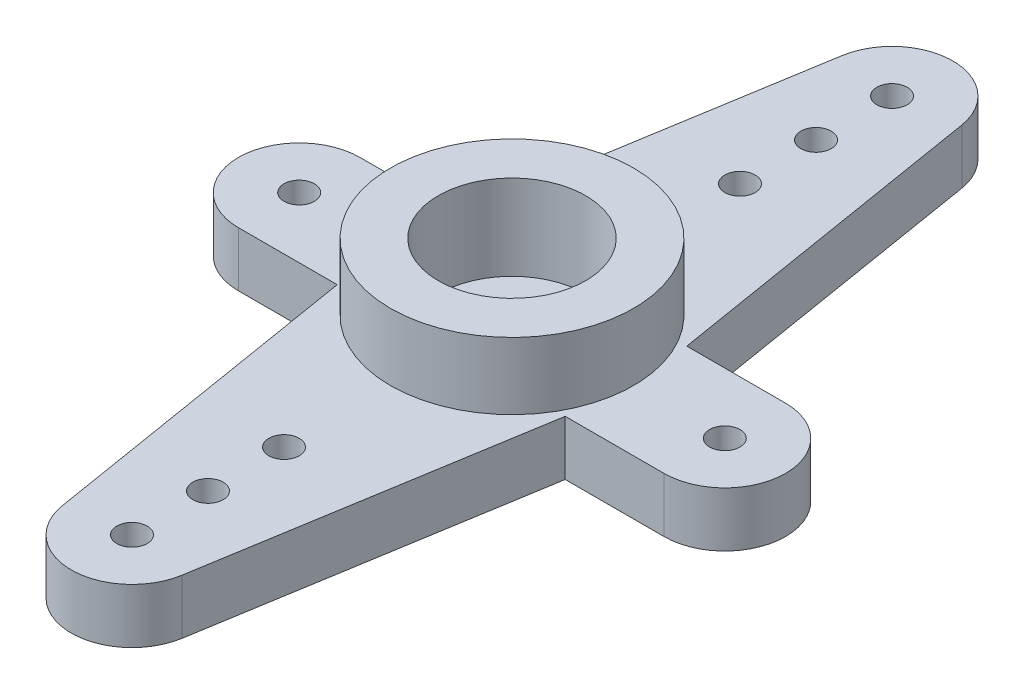
ISO-10303-21;
HEADER;
FILE_DESCRIPTION(('STEP AP214'),'2;1');
FILE_NAME('part.step','',(''),(''),'','','');
FILE_SCHEMA(('AUTOMOTIVE_DESIGN { 1 0 10303 214 1 1 1 1 }'));
ENDSEC;
DATA;
#1=APPLICATION_CONTEXT('core data for automotive mechanical design processes');
#2=APPLICATION_PROTOCOL_DEFINITION('international standard','automotive_design',2000,#1);
#3=PRODUCT_CONTEXT('',#1,'mechanical');
#4=PRODUCT('Part','Part','',(#3));
#5=PRODUCT_RELATED_PRODUCT_CATEGORY('part','',(#4));
#6=PRODUCT_DEFINITION_FORMATION('','',#4);
#7=PRODUCT_DEFINITION_CONTEXT('part definition',#1,'design');
#8=PRODUCT_DEFINITION('design','',#6,#7);
#9=PRODUCT_DEFINITION_SHAPE('','',#8);
#10=(LENGTH_UNIT() NAMED_UNIT(*) SI_UNIT(.MILLI.,.METRE.));
#11=(NAMED_UNIT(*) PLANE_ANGLE_UNIT() SI_UNIT($,.RADIAN.));
#12=(NAMED_UNIT(*) SI_UNIT($,.STERADIAN.) SOLID_ANGLE_UNIT());
#13=UNCERTAINTY_MEASURE_WITH_UNIT(LENGTH_MEASURE(1.E-05),#10,'distance_accuracy_value','');
#14=(GEOMETRIC_REPRESENTATION_CONTEXT(3) GLOBAL_UNCERTAINTY_ASSIGNED_CONTEXT((#13)) GLOBAL_UNIT_ASSIGNED_CONTEXT((#10,
#11,#12)) REPRESENTATION_CONTEXT('',''));
#15=CARTESIAN_POINT('',(0.,0.,0.));
#16=DIRECTION('',(0.,0.,1.));
#17=DIRECTION('',(1.,0.,0.));
#18=AXIS2_PLACEMENT_3D('',#15,#16,#17);
#19=CARTESIAN_POINT('',(-7.,1.8,0.));
#20=DIRECTION('',(0.,1.,0.));
#21=DIRECTION('',(0.,0.,1.));
#22=AXIS2_PLACEMENT_3D('',#19,#20,#21);
#23=PLANE('',#22);
#24=CARTESIAN_POINT('',(0.,1.8,12.5));
#25=DIRECTION('',(0.,1.,0.));
#26=DIRECTION('',(0.,0.,1.));
#27=AXIS2_PLACEMENT_3D('',#24,#25,#26);
#28=CIRCLE('',#27,0.5);
#29=CARTESIAN_POINT('',(0.,1.8,13.));
#30=VERTEX_POINT('',#29);
#31=EDGE_CURVE('E319',#30,#30,#28,.T.);
#32=ORIENTED_EDGE('',*,*,#31,.F.);
#33=EDGE_LOOP('',(#32));
#34=FACE_BOUND('',#33,.T.);
#35=CARTESIAN_POINT('',(0.,1.8,10.));
#36=DIRECTION('',(0.,1.,0.));
#37=DIRECTION('',(0.,0.,1.));
#38=AXIS2_PLACEMENT_3D('',#35,#36,#37);
#39=CIRCLE('',#38,0.5);
#40=CARTESIAN_POINT('',(0.,1.8,10.5));
#41=VERTEX_POINT('',#40);
#42=EDGE_CURVE('E321',#41,#41,#39,.T.);
#43=ORIENTED_EDGE('',*,*,#42,.F.);
#44=EDGE_LOOP('',(#43));
#45=FACE_BOUND('',#44,.T.);
#46=CARTESIAN_POINT('',(0.,1.8,-12.5));
#47=DIRECTION('',(0.,1.,0.));
#48=DIRECTION('',(0.,0.,1.));
#49=AXIS2_PLACEMENT_3D('',#46,#47,#48);
#50=CIRCLE('',#49,0.5);
#51=CARTESIAN_POINT('',(0.,1.8,-12.));
#52=VERTEX_POINT('',#51);
#53=EDGE_CURVE('E327',#52,#52,#50,.T.);
#54=ORIENTED_EDGE('',*,*,#53,.F.);
#55=EDGE_LOOP('',(#54));
#56=FACE_BOUND('',#55,.T.);
#57=CARTESIAN_POINT('',(0.,1.8,-10.));
#58=DIRECTION('',(0.,1.,0.));
#59=DIRECTION('',(0.,0.,1.));
#60=AXIS2_PLACEMENT_3D('',#57,#58,#59);
#61=CIRCLE('',#60,0.5);
#62=CARTESIAN_POINT('',(0.,1.8,-9.5));
#63=VERTEX_POINT('',#62);
#64=EDGE_CURVE('E333',#63,#63,#61,.T.);
#65=ORIENTED_EDGE('',*,*,#64,.F.);
#66=EDGE_LOOP('',(#65));
#67=FACE_BOUND('',#66,.T.);
#68=CARTESIAN_POINT('',(0.,1.8,7.5));
#69=DIRECTION('',(0.,1.,0.));
#70=DIRECTION('',(0.,0.,1.));
#71=AXIS2_PLACEMENT_3D('',#68,#69,#70);
#72=CIRCLE('',#71,0.5);
#73=CARTESIAN_POINT('',(0.,1.8,8.));
#74=VERTEX_POINT('',#73);
#75=EDGE_CURVE('E339',#74,#74,#72,.T.);
#76=ORIENTED_EDGE('',*,*,#75,.F.);
#77=EDGE_LOOP('',(#76));
#78=FACE_BOUND('',#77,.T.);
#79=CARTESIAN_POINT('',(0.,1.8,-7.5));
#80=DIRECTION('',(0.,1.,0.));
#81=DIRECTION('',(0.,0.,1.));
#82=AXIS2_PLACEMENT_3D('',#79,#80,#81);
#83=CIRCLE('',#82,0.5);
#84=CARTESIAN_POINT('',(0.,1.8,-7.));
#85=VERTEX_POINT('',#84);
#86=EDGE_CURVE('E345',#85,#85,#83,.T.);
#87=ORIENTED_EDGE('',*,*,#86,.F.);
#88=EDGE_LOOP('',(#87));
#89=FACE_BOUND('',#88,.T.);
#90=CARTESIAN_POINT('',(7.,1.8,0.));
#91=DIRECTION('',(0.,1.,0.));
#92=DIRECTION('',(0.,0.,1.));
#93=AXIS2_PLACEMENT_3D('',#90,#91,#92);
#94=CIRCLE('',#93,0.5);
#95=CARTESIAN_POINT('',(7.,1.8,0.5));
#96=VERTEX_POINT('',#95);
#97=EDGE_CURVE('E351',#96,#96,#94,.T.);
#98=ORIENTED_EDGE('',*,*,#97,.F.);
#99=EDGE_LOOP('',(#98));
#100=FACE_BOUND('',#99,.T.);
#101=CARTESIAN_POINT('',(-7.,1.8,0.));
#102=DIRECTION('',(0.,1.,0.));
#103=DIRECTION('',(0.,0.,1.));
#104=AXIS2_PLACEMENT_3D('',#101,#102,#103);
#105=CIRCLE('',#104,0.5);
#106=CARTESIAN_POINT('',(-7.,1.8,0.5));
#107=VERTEX_POINT('',#106);
#108=EDGE_CURVE('E357',#107,#107,#105,.T.);
#109=ORIENTED_EDGE('',*,*,#108,.F.);
#110=EDGE_LOOP('',(#109));
#111=FACE_BOUND('',#110,.T.);
#112=DIRECTION('',(-1.,0.,0.));
#113=VECTOR('',#112,1.);
#114=CARTESIAN_POINT('',(-3.75,1.8,-2.));
#115=LINE('',#114,#113);
#116=CARTESIAN_POINT('',(-3.75,1.8,-2.));
#117=VERTEX_POINT('',#116);
#118=CARTESIAN_POINT('',(-7.,1.8,-2.));
#119=VERTEX_POINT('',#118);
#120=EDGE_CURVE('E178',#117,#119,#115,.T.);
#121=ORIENTED_EDGE('',*,*,#120,.T.);
#122=CARTESIAN_POINT('',(-7.,1.8,0.));
#123=DIRECTION('',(0.,1.,0.));
#124=DIRECTION('',(0.,0.,1.));
#125=AXIS2_PLACEMENT_3D('',#122,#123,#124);
#126=CIRCLE('',#125,2.);
#127=CARTESIAN_POINT('',(-7.,1.8,2.));
#128=VERTEX_POINT('',#127);
#129=EDGE_CURVE('E106',#119,#128,#126,.T.);
#130=ORIENTED_EDGE('',*,*,#129,.T.);
#131=DIRECTION('',(1.,0.,0.));
#132=VECTOR('',#131,1.);
#133=CARTESIAN_POINT('',(-3.75,1.8,2.));
#134=LINE('',#133,#132);
#135=CARTESIAN_POINT('',(-3.75,1.8,2.));
#136=VERTEX_POINT('',#135);
#137=EDGE_CURVE('E205',#128,#136,#134,.T.);
#138=ORIENTED_EDGE('',*,*,#137,.T.);
#139=DIRECTION('',(0.161951899977078,0.,0.986798653269153));
#140=VECTOR('',#139,1.);
#141=CARTESIAN_POINT('',(-3.75,1.8,2.));
#142=LINE('',#141,#140);
#143=CARTESIAN_POINT('',(-1.97359730653831,1.8,12.8239037999542));
#144=VERTEX_POINT('',#143);
#145=EDGE_CURVE('E223',#136,#144,#142,.T.);
#146=ORIENTED_EDGE('',*,*,#145,.T.);
#147=CARTESIAN_POINT('',(0.,1.8,12.5));
#148=DIRECTION('',(0.,1.,0.));
#149=DIRECTION('',(0.,0.,1.));
#150=AXIS2_PLACEMENT_3D('',#147,#148,#149);
#151=CIRCLE('',#150,2.);
#152=CARTESIAN_POINT('',(1.97359730653831,1.8,12.8239037999542));
#153=VERTEX_POINT('',#152);
#154=EDGE_CURVE('E220',#144,#153,#151,.T.);
#155=ORIENTED_EDGE('',*,*,#154,.T.);
#156=DIRECTION('',(0.161951899977079,0.,-0.986798653269153));
#157=VECTOR('',#156,1.);
#158=CARTESIAN_POINT('',(3.75,1.8,2.));
#159=LINE('',#158,#157);
#160=CARTESIAN_POINT('',(3.75,1.8,2.));
#161=VERTEX_POINT('',#160);
#162=EDGE_CURVE('E222',#153,#161,#159,.T.);
#163=ORIENTED_EDGE('',*,*,#162,.T.);
#164=DIRECTION('',(1.,0.,0.));
#165=VECTOR('',#164,1.);
#166=CARTESIAN_POINT('',(3.75,1.8,2.));
#167=LINE('',#166,#165);
#168=CARTESIAN_POINT('',(7.,1.8,2.));
#169=VERTEX_POINT('',#168);
#170=EDGE_CURVE('E225',#161,#169,#167,.T.);
#171=ORIENTED_EDGE('',*,*,#170,.T.);
#172=CARTESIAN_POINT('',(7.00000000000001,1.8,0.));
#173=DIRECTION('',(0.,1.,0.));
#174=DIRECTION('',(0.,0.,-1.));
#175=AXIS2_PLACEMENT_3D('',#172,#173,#174);
#176=CIRCLE('',#175,2.);
#177=CARTESIAN_POINT('',(7.,1.8,-2.));
#178=VERTEX_POINT('',#177);
#179=EDGE_CURVE('E231',#169,#178,#176,.T.);
#180=ORIENTED_EDGE('',*,*,#179,.T.);
#181=DIRECTION('',(-1.,0.,0.));
#182=VECTOR('',#181,1.);
#183=CARTESIAN_POINT('',(3.75,1.8,-2.));
#184=LINE('',#183,#182);
#185=CARTESIAN_POINT('',(3.75,1.8,-2.));
#186=VERTEX_POINT('',#185);
#187=EDGE_CURVE('E137',#178,#186,#184,.T.);
#188=ORIENTED_EDGE('',*,*,#187,.T.);
#189=DIRECTION('',(-0.161951899977079,0.,-0.986798653269153));
#190=VECTOR('',#189,1.);
#191=CARTESIAN_POINT('',(3.75,1.8,-2.));
#192=LINE('',#191,#190);
#193=CARTESIAN_POINT('',(1.97359730653831,1.8,-12.8239037999542));
#194=VERTEX_POINT('',#193);
#195=EDGE_CURVE('E131',#186,#194,#192,.T.);
#196=ORIENTED_EDGE('',*,*,#195,.T.);
#197=CARTESIAN_POINT('',(0.,1.8,-12.5));
#198=DIRECTION('',(0.,1.,0.));
#199=DIRECTION('',(0.,0.,-1.));
#200=AXIS2_PLACEMENT_3D('',#197,#198,#199);
#201=CIRCLE('',#200,2.);
#202=CARTESIAN_POINT('',(-1.97359730653831,1.8,-12.8239037999542));
#203=VERTEX_POINT('',#202);
#204=EDGE_CURVE('E135',#194,#203,#201,.T.);
#205=ORIENTED_EDGE('',*,*,#204,.T.);
#206=DIRECTION('',(-0.161951899977078,0.,0.986798653269153));
#207=VECTOR('',#206,1.);
#208=CARTESIAN_POINT('',(-3.75,1.8,-2.));
#209=LINE('',#208,#207);
#210=EDGE_CURVE('E51',#203,#117,#209,.T.);
#211=ORIENTED_EDGE('',*,*,#210,.T.);
#212=EDGE_LOOP('',(#121,#130,#138,#146,#155,#163,#171,#180,#188,#196,#205,#211));
#213=FACE_BOUND('',#212,.T.);
#214=CARTESIAN_POINT('',(0.,1.8,0.));
#215=DIRECTION('',(0.,1.,0.));
#216=DIRECTION('',(0.,0.,1.));
#217=AXIS2_PLACEMENT_3D('',#214,#215,#216);
#218=CIRCLE('',#217,4.);
#219=CARTESIAN_POINT('',(0.,1.8,4.));
#220=VERTEX_POINT('',#219);
#221=EDGE_CURVE('E369',#220,#220,#218,.T.);
#222=ORIENTED_EDGE('',*,*,#221,.F.);
#223=EDGE_LOOP('',(#222));
#224=FACE_BOUND('',#223,.T.);
#225=ADVANCED_FACE('F34',(#34,#45,#56,#67,#78,#89,#100,#111,#213,#224),#23,.T.);
#226=CARTESIAN_POINT('',(-3.75,1.8,-2.));
#227=DIRECTION('',(0.,0.,1.));
#228=DIRECTION('',(1.,0.,0.));
#229=AXIS2_PLACEMENT_3D('',#226,#227,#228);
#230=PLANE('',#229);
#231=DIRECTION('',(-1.,0.,0.));
#232=VECTOR('',#231,1.);
#233=CARTESIAN_POINT('',(-3.75,0.,-2.));
#234=LINE('',#233,#232);
#235=CARTESIAN_POINT('',(-3.75,0.,-2.));
#236=VERTEX_POINT('',#235);
#237=CARTESIAN_POINT('',(-7.,0.,-2.));
#238=VERTEX_POINT('',#237);
#239=EDGE_CURVE('E155',#236,#238,#234,.T.);
#240=ORIENTED_EDGE('',*,*,#239,.T.);
#241=DIRECTION('',(0.,-1.,0.));
#242=VECTOR('',#241,1.);
#243=CARTESIAN_POINT('',(-7.,1.8,-2.));
#244=LINE('',#243,#242);
#245=EDGE_CURVE('E12',#119,#238,#244,.T.);
#246=ORIENTED_EDGE('',*,*,#245,.F.);
#247=ORIENTED_EDGE('',*,*,#120,.F.);
#248=DIRECTION('',(0.,-1.,0.));
#249=VECTOR('',#248,1.);
#250=CARTESIAN_POINT('',(-3.75,1.8,-2.));
#251=LINE('',#250,#249);
#252=EDGE_CURVE('E151',#117,#236,#251,.T.);
#253=ORIENTED_EDGE('',*,*,#252,.T.);
#254=EDGE_LOOP('',(#240,#246,#247,#253));
#255=FACE_BOUND('',#254,.T.);
#256=ADVANCED_FACE('F36',(#255),#230,.F.);
#257=CARTESIAN_POINT('',(-7.,1.8,0.));
#258=DIRECTION('',(0.,-1.,0.));
#259=DIRECTION('',(0.,0.,-1.));
#260=AXIS2_PLACEMENT_3D('',#257,#258,#259);
#261=CYLINDRICAL_SURFACE('',#260,2.);
#262=CARTESIAN_POINT('',(-7.,0.,0.));
#263=DIRECTION('',(0.,1.,0.));
#264=DIRECTION('',(0.,0.,1.));
#265=AXIS2_PLACEMENT_3D('',#262,#263,#264);
#266=CIRCLE('',#265,2.);
#267=CARTESIAN_POINT('',(-7.,0.,2.));
#268=VERTEX_POINT('',#267);
#269=EDGE_CURVE('E158',#238,#268,#266,.T.);
#270=ORIENTED_EDGE('',*,*,#269,.T.);
#271=DIRECTION('',(0.,-1.,0.));
#272=VECTOR('',#271,1.);
#273=CARTESIAN_POINT('',(-7.,1.8,2.));
#274=LINE('',#273,#272);
#275=EDGE_CURVE('E43',#128,#268,#274,.T.);
#276=ORIENTED_EDGE('',*,*,#275,.F.);
#277=ORIENTED_EDGE('',*,*,#129,.F.);
#278=ORIENTED_EDGE('',*,*,#245,.T.);
#279=EDGE_LOOP('',(#270,#276,#277,#278));
#280=FACE_BOUND('',#279,.T.);
#281=ADVANCED_FACE('F262',(#280),#261,.T.);
#282=CARTESIAN_POINT('',(-3.75,1.8,2.));
#283=DIRECTION('',(0.,0.,-1.));
#284=DIRECTION('',(-1.,0.,0.));
#285=AXIS2_PLACEMENT_3D('',#282,#283,#284);
#286=PLANE('',#285);
#287=DIRECTION('',(1.,0.,0.));
#288=VECTOR('',#287,1.);
#289=CARTESIAN_POINT('',(-3.75,0.,2.));
#290=LINE('',#289,#288);
#291=CARTESIAN_POINT('',(-3.75,0.,2.));
#292=VERTEX_POINT('',#291);
#293=EDGE_CURVE('E161',#268,#292,#290,.T.);
#294=ORIENTED_EDGE('',*,*,#293,.T.);
#295=DIRECTION('',(0.,-1.,0.));
#296=VECTOR('',#295,1.);
#297=CARTESIAN_POINT('',(-3.75,1.8,2.));
#298=LINE('',#297,#296);
#299=EDGE_CURVE('E197',#136,#292,#298,.T.);
#300=ORIENTED_EDGE('',*,*,#299,.F.);
#301=ORIENTED_EDGE('',*,*,#137,.F.);
#302=ORIENTED_EDGE('',*,*,#275,.T.);
#303=EDGE_LOOP('',(#294,#300,#301,#302));
#304=FACE_BOUND('',#303,.T.);
#305=ADVANCED_FACE('F203',(#304),#286,.F.);
#306=CARTESIAN_POINT('',(-3.75,1.8,2.));
#307=DIRECTION('',(0.986798653269153,0.,-0.161951899977078));
#308=DIRECTION('',(-0.161951899977078,0.,-0.986798653269153));
#309=AXIS2_PLACEMENT_3D('',#306,#307,#308);
#310=PLANE('',#309);
#311=DIRECTION('',(0.161951899977078,0.,0.986798653269153));
#312=VECTOR('',#311,1.);
#313=CARTESIAN_POINT('',(-3.75,0.,2.));
#314=LINE('',#313,#312);
#315=CARTESIAN_POINT('',(-1.97359730653831,0.,12.8239037999542));
#316=VERTEX_POINT('',#315);
#317=EDGE_CURVE('E163',#292,#316,#314,.T.);
#318=ORIENTED_EDGE('',*,*,#317,.T.);
#319=DIRECTION('',(0.,-1.,0.));
#320=VECTOR('',#319,1.);
#321=CARTESIAN_POINT('',(-1.97359730653831,1.8,12.8239037999542));
#322=LINE('',#321,#320);
#323=EDGE_CURVE('E194',#144,#316,#322,.T.);
#324=ORIENTED_EDGE('',*,*,#323,.F.);
#325=ORIENTED_EDGE('',*,*,#145,.F.);
#326=ORIENTED_EDGE('',*,*,#299,.T.);
#327=EDGE_LOOP('',(#318,#324,#325,#326));
#328=FACE_BOUND('',#327,.T.);
#329=ADVANCED_FACE('F214',(#328),#310,.F.);
#330=CARTESIAN_POINT('',(0.,1.8,12.5));
#331=DIRECTION('',(0.,-1.,0.));
#332=DIRECTION('',(0.,0.,-1.));
#333=AXIS2_PLACEMENT_3D('',#330,#331,#332);
#334=CYLINDRICAL_SURFACE('',#333,2.);
#335=CARTESIAN_POINT('',(0.,0.,12.5));
#336=DIRECTION('',(0.,1.,0.));
#337=DIRECTION('',(0.,0.,1.));
#338=AXIS2_PLACEMENT_3D('',#335,#336,#337);
#339=CIRCLE('',#338,2.);
#340=CARTESIAN_POINT('',(1.97359730653831,0.,12.8239037999542));
#341=VERTEX_POINT('',#340);
#342=EDGE_CURVE('E165',#316,#341,#339,.T.);
#343=ORIENTED_EDGE('',*,*,#342,.T.);
#344=DIRECTION('',(0.,-1.,0.));
#345=VECTOR('',#344,1.);
#346=CARTESIAN_POINT('',(1.97359730653831,1.8,12.8239037999542));
#347=LINE('',#346,#345);
#348=EDGE_CURVE('E191',#153,#341,#347,.T.);
#349=ORIENTED_EDGE('',*,*,#348,.F.);
#350=ORIENTED_EDGE('',*,*,#154,.F.);
#351=ORIENTED_EDGE('',*,*,#323,.T.);
#352=EDGE_LOOP('',(#343,#349,#350,#351));
#353=FACE_BOUND('',#352,.T.);
#354=ADVANCED_FACE('F218',(#353),#334,.T.);
#355=CARTESIAN_POINT('',(3.75,1.8,2.));
#356=DIRECTION('',(-0.986798653269153,0.,-0.161951899977079));
#357=DIRECTION('',(-0.161951899977079,0.,0.986798653269153));
#358=AXIS2_PLACEMENT_3D('',#355,#356,#357);
#359=PLANE('',#358);
#360=DIRECTION('',(0.161951899977079,0.,-0.986798653269153));
#361=VECTOR('',#360,1.);
#362=CARTESIAN_POINT('',(3.75,0.,2.));
#363=LINE('',#362,#361);
#364=CARTESIAN_POINT('',(3.75,0.,2.));
#365=VERTEX_POINT('',#364);
#366=EDGE_CURVE('E167',#341,#365,#363,.T.);
#367=ORIENTED_EDGE('',*,*,#366,.T.);
#368=DIRECTION('',(0.,-1.,0.));
#369=VECTOR('',#368,1.);
#370=CARTESIAN_POINT('',(3.75,1.8,2.));
#371=LINE('',#370,#369);
#372=EDGE_CURVE('E188',#161,#365,#371,.T.);
#373=ORIENTED_EDGE('',*,*,#372,.F.);
#374=ORIENTED_EDGE('',*,*,#162,.F.);
#375=ORIENTED_EDGE('',*,*,#348,.T.);
#376=EDGE_LOOP('',(#367,#373,#374,#375));
#377=FACE_BOUND('',#376,.T.);
#378=ADVANCED_FACE('F535',(#377),#359,.F.);
#379=CARTESIAN_POINT('',(3.75,1.8,2.));
#380=DIRECTION('',(0.,0.,-1.));
#381=DIRECTION('',(-1.,0.,0.));
#382=AXIS2_PLACEMENT_3D('',#379,#380,#381);
#383=PLANE('',#382);
#384=DIRECTION('',(1.,0.,0.));
#385=VECTOR('',#384,1.);
#386=CARTESIAN_POINT('',(3.75,0.,2.));
#387=LINE('',#386,#385);
#388=CARTESIAN_POINT('',(7.,0.,2.));
#389=VERTEX_POINT('',#388);
#390=EDGE_CURVE('E169',#365,#389,#387,.T.);
#391=ORIENTED_EDGE('',*,*,#390,.T.);
#392=DIRECTION('',(0.,-1.,0.));
#393=VECTOR('',#392,1.);
#394=CARTESIAN_POINT('',(7.,1.8,2.));
#395=LINE('',#394,#393);
#396=EDGE_CURVE('E185',#169,#389,#395,.T.);
#397=ORIENTED_EDGE('',*,*,#396,.F.);
#398=ORIENTED_EDGE('',*,*,#170,.F.);
#399=ORIENTED_EDGE('',*,*,#372,.T.);
#400=EDGE_LOOP('',(#391,#397,#398,#399));
#401=FACE_BOUND('',#400,.T.);
#402=ADVANCED_FACE('F527',(#401),#383,.F.);
#403=CARTESIAN_POINT('',(7.00000000000001,1.8,0.));
#404=DIRECTION('',(0.,-1.,0.));
#405=DIRECTION('',(0.,0.,-1.));
#406=AXIS2_PLACEMENT_3D('',#403,#404,#405);
#407=CYLINDRICAL_SURFACE('',#406,2.);
#408=CARTESIAN_POINT('',(7.00000000000001,0.,0.));
#409=DIRECTION('',(0.,1.,0.));
#410=DIRECTION('',(0.,0.,-1.));
#411=AXIS2_PLACEMENT_3D('',#408,#409,#410);
#412=CIRCLE('',#411,2.);
#413=CARTESIAN_POINT('',(7.,0.,-2.));
#414=VERTEX_POINT('',#413);
#415=EDGE_CURVE('E171',#389,#414,#412,.T.);
#416=ORIENTED_EDGE('',*,*,#415,.T.);
#417=DIRECTION('',(0.,-1.,0.));
#418=VECTOR('',#417,1.);
#419=CARTESIAN_POINT('',(7.,1.8,-2.));
#420=LINE('',#419,#418);
#421=EDGE_CURVE('E182',#178,#414,#420,.T.);
#422=ORIENTED_EDGE('',*,*,#421,.F.);
#423=ORIENTED_EDGE('',*,*,#179,.F.);
#424=ORIENTED_EDGE('',*,*,#396,.T.);
#425=EDGE_LOOP('',(#416,#422,#423,#424));
#426=FACE_BOUND('',#425,.T.);
#427=ADVANCED_FACE('F237',(#426),#407,.T.);
#428=CARTESIAN_POINT('',(3.75,1.8,-2.));
#429=DIRECTION('',(0.,0.,1.));
#430=DIRECTION('',(1.,0.,0.));
#431=AXIS2_PLACEMENT_3D('',#428,#429,#430);
#432=PLANE('',#431);
#433=DIRECTION('',(-1.,0.,0.));
#434=VECTOR('',#433,1.);
#435=CARTESIAN_POINT('',(3.75,0.,-2.));
#436=LINE('',#435,#434);
#437=CARTESIAN_POINT('',(3.75,0.,-2.));
#438=VERTEX_POINT('',#437);
#439=EDGE_CURVE('E173',#414,#438,#436,.T.);
#440=ORIENTED_EDGE('',*,*,#439,.T.);
#441=DIRECTION('',(0.,-1.,0.));
#442=VECTOR('',#441,1.);
#443=CARTESIAN_POINT('',(3.75,1.8,-2.));
#444=LINE('',#443,#442);
#445=EDGE_CURVE('E146',#186,#438,#444,.T.);
#446=ORIENTED_EDGE('',*,*,#445,.F.);
#447=ORIENTED_EDGE('',*,*,#187,.F.);
#448=ORIENTED_EDGE('',*,*,#421,.T.);
#449=EDGE_LOOP('',(#440,#446,#447,#448));
#450=FACE_BOUND('',#449,.T.);
#451=ADVANCED_FACE('F241',(#450),#432,.F.);
#452=CARTESIAN_POINT('',(3.75,1.8,-2.));
#453=DIRECTION('',(-0.986798653269153,0.,0.161951899977079));
#454=DIRECTION('',(0.161951899977079,0.,0.986798653269153));
#455=AXIS2_PLACEMENT_3D('',#452,#453,#454);
#456=PLANE('',#455);
#457=DIRECTION('',(-0.161951899977079,0.,-0.986798653269153));
#458=VECTOR('',#457,1.);
#459=CARTESIAN_POINT('',(3.75,0.,-2.));
#460=LINE('',#459,#458);
#461=CARTESIAN_POINT('',(1.97359730653831,0.,-12.8239037999542));
#462=VERTEX_POINT('',#461);
#463=EDGE_CURVE('E145',#438,#462,#460,.T.);
#464=ORIENTED_EDGE('',*,*,#463,.T.);
#465=DIRECTION('',(0.,-1.,0.));
#466=VECTOR('',#465,1.);
#467=CARTESIAN_POINT('',(1.97359730653831,1.8,-12.8239037999542));
#468=LINE('',#467,#466);
#469=EDGE_CURVE('E142',#194,#462,#468,.T.);
#470=ORIENTED_EDGE('',*,*,#469,.F.);
#471=ORIENTED_EDGE('',*,*,#195,.F.);
#472=ORIENTED_EDGE('',*,*,#445,.T.);
#473=EDGE_LOOP('',(#464,#470,#471,#472));
#474=FACE_BOUND('',#473,.T.);
#475=ADVANCED_FACE('F143',(#474),#456,.F.);
#476=CARTESIAN_POINT('',(0.,1.8,-12.5));
#477=DIRECTION('',(0.,-1.,0.));
#478=DIRECTION('',(0.,0.,-1.));
#479=AXIS2_PLACEMENT_3D('',#476,#477,#478);
#480=CYLINDRICAL_SURFACE('',#479,2.);
#481=CARTESIAN_POINT('',(0.,0.,-12.5));
#482=DIRECTION('',(0.,1.,0.));
#483=DIRECTION('',(0.,0.,-1.));
#484=AXIS2_PLACEMENT_3D('',#481,#482,#483);
#485=CIRCLE('',#484,2.);
#486=CARTESIAN_POINT('',(-1.97359730653831,0.,-12.8239037999542));
#487=VERTEX_POINT('',#486);
#488=EDGE_CURVE('E92',#462,#487,#485,.T.);
#489=ORIENTED_EDGE('',*,*,#488,.T.);
#490=DIRECTION('',(0.,-1.,0.));
#491=VECTOR('',#490,1.);
#492=CARTESIAN_POINT('',(-1.97359730653831,1.8,-12.8239037999542));
#493=LINE('',#492,#491);
#494=EDGE_CURVE('E147',#203,#487,#493,.T.);
#495=ORIENTED_EDGE('',*,*,#494,.F.);
#496=ORIENTED_EDGE('',*,*,#204,.F.);
#497=ORIENTED_EDGE('',*,*,#469,.T.);
#498=EDGE_LOOP('',(#489,#495,#496,#497));
#499=FACE_BOUND('',#498,.T.);
#500=ADVANCED_FACE('F149',(#499),#480,.T.);
#501=CARTESIAN_POINT('',(-3.75,1.8,-2.));
#502=DIRECTION('',(0.986798653269153,0.,0.161951899977078));
#503=DIRECTION('',(0.161951899977078,0.,-0.986798653269153));
#504=AXIS2_PLACEMENT_3D('',#501,#502,#503);
#505=PLANE('',#504);
#506=DIRECTION('',(-0.161951899977078,0.,0.986798653269153));
#507=VECTOR('',#506,1.);
#508=CARTESIAN_POINT('',(-3.75,0.,-2.));
#509=LINE('',#508,#507);
#510=EDGE_CURVE('E98',#487,#236,#509,.T.);
#511=ORIENTED_EDGE('',*,*,#510,.T.);
#512=ORIENTED_EDGE('',*,*,#252,.F.);
#513=ORIENTED_EDGE('',*,*,#210,.F.);
#514=ORIENTED_EDGE('',*,*,#494,.T.);
#515=EDGE_LOOP('',(#511,#512,#513,#514));
#516=FACE_BOUND('',#515,.T.);
#517=ADVANCED_FACE('F245',(#516),#505,.F.);
#518=CARTESIAN_POINT('',(-7.,0.,0.));
#519=DIRECTION('',(0.,1.,0.));
#520=DIRECTION('',(0.,0.,1.));
#521=AXIS2_PLACEMENT_3D('',#518,#519,#520);
#522=PLANE('',#521);
#523=CARTESIAN_POINT('',(0.,0.,12.5));
#524=DIRECTION('',(0.,1.,0.));
#525=DIRECTION('',(0.,0.,1.));
#526=AXIS2_PLACEMENT_3D('',#523,#524,#525);
#527=CIRCLE('',#526,0.5);
#528=CARTESIAN_POINT('',(0.,0.,13.));
#529=VERTEX_POINT('',#528);
#530=EDGE_CURVE('E317',#529,#529,#527,.T.);
#531=ORIENTED_EDGE('',*,*,#530,.T.);
#532=EDGE_LOOP('',(#531));
#533=FACE_BOUND('',#532,.T.);
#534=CARTESIAN_POINT('',(0.,0.,10.));
#535=DIRECTION('',(0.,1.,0.));
#536=DIRECTION('',(0.,0.,1.));
#537=AXIS2_PLACEMENT_3D('',#534,#535,#536);
#538=CIRCLE('',#537,0.5);
#539=CARTESIAN_POINT('',(0.,0.,10.5));
#540=VERTEX_POINT('',#539);
#541=EDGE_CURVE('E324',#540,#540,#538,.T.);
#542=ORIENTED_EDGE('',*,*,#541,.T.);
#543=EDGE_LOOP('',(#542));
#544=FACE_BOUND('',#543,.T.);
#545=CARTESIAN_POINT('',(0.,0.,-12.5));
#546=DIRECTION('',(0.,1.,0.));
#547=DIRECTION('',(0.,0.,1.));
#548=AXIS2_PLACEMENT_3D('',#545,#546,#547);
#549=CIRCLE('',#548,0.5);
#550=CARTESIAN_POINT('',(0.,0.,-12.));
#551=VERTEX_POINT('',#550);
#552=EDGE_CURVE('E330',#551,#551,#549,.T.);
#553=ORIENTED_EDGE('',*,*,#552,.T.);
#554=EDGE_LOOP('',(#553));
#555=FACE_BOUND('',#554,.T.);
#556=CARTESIAN_POINT('',(0.,0.,-10.));
#557=DIRECTION('',(0.,1.,0.));
#558=DIRECTION('',(0.,0.,1.));
#559=AXIS2_PLACEMENT_3D('',#556,#557,#558);
#560=CIRCLE('',#559,0.5);
#561=CARTESIAN_POINT('',(0.,0.,-9.5));
#562=VERTEX_POINT('',#561);
#563=EDGE_CURVE('E336',#562,#562,#560,.T.);
#564=ORIENTED_EDGE('',*,*,#563,.T.);
#565=EDGE_LOOP('',(#564));
#566=FACE_BOUND('',#565,.T.);
#567=CARTESIAN_POINT('',(0.,0.,7.5));
#568=DIRECTION('',(0.,1.,0.));
#569=DIRECTION('',(0.,0.,1.));
#570=AXIS2_PLACEMENT_3D('',#567,#568,#569);
#571=CIRCLE('',#570,0.5);
#572=CARTESIAN_POINT('',(0.,0.,8.));
#573=VERTEX_POINT('',#572);
#574=EDGE_CURVE('E342',#573,#573,#571,.T.);
#575=ORIENTED_EDGE('',*,*,#574,.T.);
#576=EDGE_LOOP('',(#575));
#577=FACE_BOUND('',#576,.T.);
#578=CARTESIAN_POINT('',(0.,0.,-7.5));
#579=DIRECTION('',(0.,1.,0.));
#580=DIRECTION('',(0.,0.,1.));
#581=AXIS2_PLACEMENT_3D('',#578,#579,#580);
#582=CIRCLE('',#581,0.5);
#583=CARTESIAN_POINT('',(0.,0.,-7.));
#584=VERTEX_POINT('',#583);
#585=EDGE_CURVE('E348',#584,#584,#582,.T.);
#586=ORIENTED_EDGE('',*,*,#585,.T.);
#587=EDGE_LOOP('',(#586));
#588=FACE_BOUND('',#587,.T.);
#589=CARTESIAN_POINT('',(7.,0.,0.));
#590=DIRECTION('',(0.,1.,0.));
#591=DIRECTION('',(0.,0.,1.));
#592=AXIS2_PLACEMENT_3D('',#589,#590,#591);
#593=CIRCLE('',#592,0.5);
#594=CARTESIAN_POINT('',(7.,0.,0.5));
#595=VERTEX_POINT('',#594);
#596=EDGE_CURVE('E354',#595,#595,#593,.T.);
#597=ORIENTED_EDGE('',*,*,#596,.T.);
#598=EDGE_LOOP('',(#597));
#599=FACE_BOUND('',#598,.T.);
#600=CARTESIAN_POINT('',(-7.,0.,0.));
#601=DIRECTION('',(0.,1.,0.));
#602=DIRECTION('',(0.,0.,1.));
#603=AXIS2_PLACEMENT_3D('',#600,#601,#602);
#604=CIRCLE('',#603,0.5);
#605=CARTESIAN_POINT('',(-7.,0.,0.5));
#606=VERTEX_POINT('',#605);
#607=EDGE_CURVE('E360',#606,#606,#604,.T.);
#608=ORIENTED_EDGE('',*,*,#607,.T.);
#609=EDGE_LOOP('',(#608));
#610=FACE_BOUND('',#609,.T.);
#611=ORIENTED_EDGE('',*,*,#239,.F.);
#612=ORIENTED_EDGE('',*,*,#510,.F.);
#613=ORIENTED_EDGE('',*,*,#488,.F.);
#614=ORIENTED_EDGE('',*,*,#463,.F.);
#615=ORIENTED_EDGE('',*,*,#439,.F.);
#616=ORIENTED_EDGE('',*,*,#415,.F.);
#617=ORIENTED_EDGE('',*,*,#390,.F.);
#618=ORIENTED_EDGE('',*,*,#366,.F.);
#619=ORIENTED_EDGE('',*,*,#342,.F.);
#620=ORIENTED_EDGE('',*,*,#317,.F.);
#621=ORIENTED_EDGE('',*,*,#293,.F.);
#622=ORIENTED_EDGE('',*,*,#269,.F.);
#623=EDGE_LOOP('',(#611,#612,#613,#614,#615,#616,#617,#618,#619,#620,#621,#622));
#624=FACE_BOUND('',#623,.T.);
#625=ADVANCED_FACE('F209',(#533,#544,#555,#566,#577,#588,#599,#610,#624),#522,.F.);
#626=CARTESIAN_POINT('',(0.,19.3137084989848,0.));
#627=DIRECTION('',(0.,-1.,0.));
#628=DIRECTION('',(0.,0.,-1.));
#629=AXIS2_PLACEMENT_3D('',#626,#627,#628);
#630=CYLINDRICAL_SURFACE('',#629,4.);
#631=ORIENTED_EDGE('',*,*,#221,.T.);
#632=EDGE_LOOP('',(#631));
#633=FACE_BOUND('',#632,.T.);
#634=CARTESIAN_POINT('',(0.,4.,0.));
#635=DIRECTION('',(0.,1.,0.));
#636=DIRECTION('',(0.,0.,1.));
#637=AXIS2_PLACEMENT_3D('',#634,#635,#636);
#638=CIRCLE('',#637,4.);
#639=CARTESIAN_POINT('',(0.,4.,4.));
#640=VERTEX_POINT('',#639);
#641=EDGE_CURVE('E159',#640,#640,#638,.T.);
#642=ORIENTED_EDGE('',*,*,#641,.F.);
#643=EDGE_LOOP('',(#642));
#644=FACE_BOUND('',#643,.T.);
#645=ADVANCED_FACE('F252',(#633,#644),#630,.T.);
#646=CARTESIAN_POINT('',(-7.,4.,0.));
#647=DIRECTION('',(0.,1.,0.));
#648=DIRECTION('',(0.,0.,1.));
#649=AXIS2_PLACEMENT_3D('',#646,#647,#648);
#650=PLANE('',#649);
#651=CARTESIAN_POINT('',(0.,4.,0.));
#652=DIRECTION('',(0.,1.,0.));
#653=DIRECTION('',(0.,0.,1.));
#654=AXIS2_PLACEMENT_3D('',#651,#652,#653);
#655=CIRCLE('',#654,2.425);
#656=CARTESIAN_POINT('',(0.,4.,2.425));
#657=VERTEX_POINT('',#656);
#658=EDGE_CURVE('E363',#657,#657,#655,.T.);
#659=ORIENTED_EDGE('',*,*,#658,.F.);
#660=EDGE_LOOP('',(#659));
#661=FACE_BOUND('',#660,.T.);
#662=ORIENTED_EDGE('',*,*,#641,.T.);
#663=EDGE_LOOP('',(#662));
#664=FACE_BOUND('',#663,.T.);
#665=ADVANCED_FACE('F266',(#661,#664),#650,.T.);
#666=CARTESIAN_POINT('',(0.,1.2,0.));
#667=DIRECTION('',(0.,1.,0.));
#668=DIRECTION('',(0.,0.,1.));
#669=AXIS2_PLACEMENT_3D('',#666,#667,#668);
#670=CYLINDRICAL_SURFACE('',#669,2.425);
#671=CARTESIAN_POINT('',(0.,1.2,0.));
#672=DIRECTION('',(0.,1.,0.));
#673=DIRECTION('',(0.,0.,1.));
#674=AXIS2_PLACEMENT_3D('',#671,#672,#673);
#675=CIRCLE('',#674,2.425);
#676=CARTESIAN_POINT('',(0.,1.2,2.425));
#677=VERTEX_POINT('',#676);
#678=EDGE_CURVE('E366',#677,#677,#675,.T.);
#679=ORIENTED_EDGE('',*,*,#678,.F.);
#680=EDGE_LOOP('',(#679));
#681=FACE_BOUND('',#680,.T.);
#682=ORIENTED_EDGE('',*,*,#658,.T.);
#683=EDGE_LOOP('',(#682));
#684=FACE_BOUND('',#683,.T.);
#685=ADVANCED_FACE('F269',(#681,#684),#670,.F.);
#686=CARTESIAN_POINT('',(0.,1.2,0.));
#687=DIRECTION('',(0.,1.,0.));
#688=DIRECTION('',(0.,0.,1.));
#689=AXIS2_PLACEMENT_3D('',#686,#687,#688);
#690=PLANE('',#689);
#691=ORIENTED_EDGE('',*,*,#678,.T.);
#692=EDGE_LOOP('',(#691));
#693=FACE_BOUND('',#692,.T.);
#694=ADVANCED_FACE('F276',(#693),#690,.T.);
#695=CARTESIAN_POINT('',(-7.,0.,0.));
#696=DIRECTION('',(0.,1.,0.));
#697=DIRECTION('',(0.,0.,1.));
#698=AXIS2_PLACEMENT_3D('',#695,#696,#697);
#699=CYLINDRICAL_SURFACE('',#698,0.5);
#700=ORIENTED_EDGE('',*,*,#607,.F.);
#701=EDGE_LOOP('',(#700));
#702=FACE_BOUND('',#701,.T.);
#703=ORIENTED_EDGE('',*,*,#108,.T.);
#704=EDGE_LOOP('',(#703));
#705=FACE_BOUND('',#704,.T.);
#706=ADVANCED_FACE('F280',(#702,#705),#699,.F.);
#707=CARTESIAN_POINT('',(7.,0.,0.));
#708=DIRECTION('',(0.,1.,0.));
#709=DIRECTION('',(0.,0.,1.));
#710=AXIS2_PLACEMENT_3D('',#707,#708,#709);
#711=CYLINDRICAL_SURFACE('',#710,0.5);
#712=ORIENTED_EDGE('',*,*,#596,.F.);
#713=EDGE_LOOP('',(#712));
#714=FACE_BOUND('',#713,.T.);
#715=ORIENTED_EDGE('',*,*,#97,.T.);
#716=EDGE_LOOP('',(#715));
#717=FACE_BOUND('',#716,.T.);
#718=ADVANCED_FACE('F284',(#714,#717),#711,.F.);
#719=CARTESIAN_POINT('',(0.,0.,-7.5));
#720=DIRECTION('',(0.,1.,0.));
#721=DIRECTION('',(0.,0.,1.));
#722=AXIS2_PLACEMENT_3D('',#719,#720,#721);
#723=CYLINDRICAL_SURFACE('',#722,0.5);
#724=ORIENTED_EDGE('',*,*,#585,.F.);
#725=EDGE_LOOP('',(#724));
#726=FACE_BOUND('',#725,.T.);
#727=ORIENTED_EDGE('',*,*,#86,.T.);
#728=EDGE_LOOP('',(#727));
#729=FACE_BOUND('',#728,.T.);
#730=ADVANCED_FACE('F288',(#726,#729),#723,.F.);
#731=CARTESIAN_POINT('',(0.,0.,7.5));
#732=DIRECTION('',(0.,1.,0.));
#733=DIRECTION('',(0.,0.,1.));
#734=AXIS2_PLACEMENT_3D('',#731,#732,#733);
#735=CYLINDRICAL_SURFACE('',#734,0.5);
#736=ORIENTED_EDGE('',*,*,#574,.F.);
#737=EDGE_LOOP('',(#736));
#738=FACE_BOUND('',#737,.T.);
#739=ORIENTED_EDGE('',*,*,#75,.T.);
#740=EDGE_LOOP('',(#739));
#741=FACE_BOUND('',#740,.T.);
#742=ADVANCED_FACE('F292',(#738,#741),#735,.F.);
#743=CARTESIAN_POINT('',(0.,0.,-10.));
#744=DIRECTION('',(0.,1.,0.));
#745=DIRECTION('',(0.,0.,1.));
#746=AXIS2_PLACEMENT_3D('',#743,#744,#745);
#747=CYLINDRICAL_SURFACE('',#746,0.5);
#748=ORIENTED_EDGE('',*,*,#563,.F.);
#749=EDGE_LOOP('',(#748));
#750=FACE_BOUND('',#749,.T.);
#751=ORIENTED_EDGE('',*,*,#64,.T.);
#752=EDGE_LOOP('',(#751));
#753=FACE_BOUND('',#752,.T.);
#754=ADVANCED_FACE('F296',(#750,#753),#747,.F.);
#755=CARTESIAN_POINT('',(0.,0.,-12.5));
#756=DIRECTION('',(0.,1.,0.));
#757=DIRECTION('',(0.,0.,1.));
#758=AXIS2_PLACEMENT_3D('',#755,#756,#757);
#759=CYLINDRICAL_SURFACE('',#758,0.5);
#760=ORIENTED_EDGE('',*,*,#552,.F.);
#761=EDGE_LOOP('',(#760));
#762=FACE_BOUND('',#761,.T.);
#763=ORIENTED_EDGE('',*,*,#53,.T.);
#764=EDGE_LOOP('',(#763));
#765=FACE_BOUND('',#764,.T.);
#766=ADVANCED_FACE('F300',(#762,#765),#759,.F.);
#767=CARTESIAN_POINT('',(0.,0.,10.));
#768=DIRECTION('',(0.,1.,0.));
#769=DIRECTION('',(0.,0.,1.));
#770=AXIS2_PLACEMENT_3D('',#767,#768,#769);
#771=CYLINDRICAL_SURFACE('',#770,0.5);
#772=ORIENTED_EDGE('',*,*,#541,.F.);
#773=EDGE_LOOP('',(#772));
#774=FACE_BOUND('',#773,.T.);
#775=ORIENTED_EDGE('',*,*,#42,.T.);
#776=EDGE_LOOP('',(#775));
#777=FACE_BOUND('',#776,.T.);
#778=ADVANCED_FACE('F304',(#774,#777),#771,.F.);
#779=CARTESIAN_POINT('',(0.,0.,12.5));
#780=DIRECTION('',(0.,1.,0.));
#781=DIRECTION('',(0.,0.,1.));
#782=AXIS2_PLACEMENT_3D('',#779,#780,#781);
#783=CYLINDRICAL_SURFACE('',#782,0.5);
#784=ORIENTED_EDGE('',*,*,#530,.F.);
#785=EDGE_LOOP('',(#784));
#786=FACE_BOUND('',#785,.T.);
#787=ORIENTED_EDGE('',*,*,#31,.T.);
#788=EDGE_LOOP('',(#787));
#789=FACE_BOUND('',#788,.T.);
#790=ADVANCED_FACE('F308',(#786,#789),#783,.F.);
#791=CLOSED_SHELL('',(#225,#256,#281,#305,#329,#354,#378,#402,#427,#451,#475,#500,#517,#625,
#645,#665,#685,#694,#706,#718,#730,#742,#754,#766,#778,#790));
#792=MANIFOLD_SOLID_BREP('B2',#791);
#793=ADVANCED_BREP_SHAPE_REPRESENTATION('',(#18,#792),#14);
#794=SHAPE_DEFINITION_REPRESENTATION(#9,#793);
ENDSEC;
END-ISO-10303-21;
